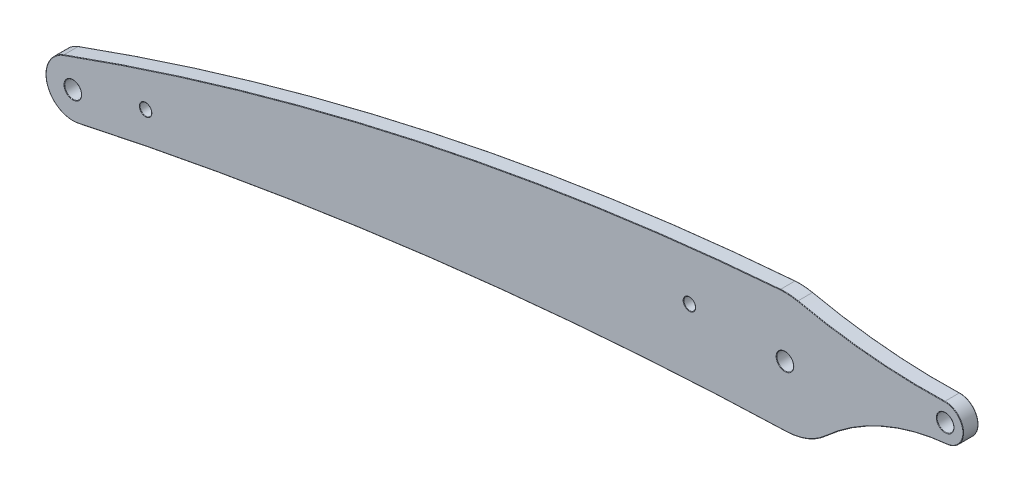
ISO-10303-21;
HEADER;
FILE_DESCRIPTION(('STEP AP214'),'2;1');
FILE_NAME('part.step','',(''),(''),'','','');
FILE_SCHEMA(('AUTOMOTIVE_DESIGN { 1 0 10303 214 1 1 1 1 }'));
ENDSEC;
DATA;
#1=APPLICATION_CONTEXT('core data for automotive mechanical design processes');
#2=APPLICATION_PROTOCOL_DEFINITION('international standard','automotive_design',2000,#1);
#3=PRODUCT_CONTEXT('',#1,'mechanical');
#4=PRODUCT('Part','Part','',(#3));
#5=PRODUCT_RELATED_PRODUCT_CATEGORY('part','',(#4));
#6=PRODUCT_DEFINITION_FORMATION('','',#4);
#7=PRODUCT_DEFINITION_CONTEXT('part definition',#1,'design');
#8=PRODUCT_DEFINITION('design','',#6,#7);
#9=PRODUCT_DEFINITION_SHAPE('','',#8);
#10=(LENGTH_UNIT() NAMED_UNIT(*) SI_UNIT(.MILLI.,.METRE.));
#11=(NAMED_UNIT(*) PLANE_ANGLE_UNIT() SI_UNIT($,.RADIAN.));
#12=(NAMED_UNIT(*) SI_UNIT($,.STERADIAN.) SOLID_ANGLE_UNIT());
#13=UNCERTAINTY_MEASURE_WITH_UNIT(LENGTH_MEASURE(1.E-05),#10,'distance_accuracy_value','');
#14=(GEOMETRIC_REPRESENTATION_CONTEXT(3) GLOBAL_UNCERTAINTY_ASSIGNED_CONTEXT((#13)) GLOBAL_UNIT_ASSIGNED_CONTEXT((#10,
#11,#12)) REPRESENTATION_CONTEXT('',''));
#15=CARTESIAN_POINT('',(0.,0.,0.));
#16=DIRECTION('',(0.,0.,1.));
#17=DIRECTION('',(1.,0.,0.));
#18=AXIS2_PLACEMENT_3D('',#15,#16,#17);
#19=CARTESIAN_POINT('',(-273.701360714426,238.82392189989,-5.));
#20=DIRECTION('',(0.,0.,1.));
#21=DIRECTION('',(1.,0.,0.));
#22=AXIS2_PLACEMENT_3D('',#19,#20,#21);
#23=CYLINDRICAL_SURFACE('',#22,8.99999999999995);
#24=DIRECTION('',(0.,0.,1.));
#25=VECTOR('',#24,1.);
#26=CARTESIAN_POINT('',(-276.780298858593,247.280879976196,-5.));
#27=LINE('',#26,#25);
#28=CARTESIAN_POINT('',(-276.780298858593,247.280879976196,-4.85));
#29=VERTEX_POINT('',#28);
#30=CARTESIAN_POINT('',(-276.780298858593,247.280879976196,-0.15));
#31=VERTEX_POINT('',#30);
#32=EDGE_CURVE('E156',#29,#31,#27,.T.);
#33=ORIENTED_EDGE('',*,*,#32,.F.);
#34=CARTESIAN_POINT('',(-273.701360714426,238.82392189989,-4.85));
#35=DIRECTION('',(0.,0.,1.));
#36=DIRECTION('',(1.,0.,0.));
#37=AXIS2_PLACEMENT_3D('',#34,#35,#36);
#38=CIRCLE('',#37,8.99999999999995);
#39=CARTESIAN_POINT('',(-271.793567604584,230.028450027953,-4.85));
#40=VERTEX_POINT('',#39);
#41=EDGE_CURVE('E151',#29,#40,#38,.T.);
#42=ORIENTED_EDGE('',*,*,#41,.T.);
#43=DIRECTION('',(0.,0.,1.));
#44=VECTOR('',#43,1.);
#45=CARTESIAN_POINT('',(-271.793567604584,230.028450027953,-5.));
#46=LINE('',#45,#44);
#47=CARTESIAN_POINT('',(-271.793567604584,230.028450027953,-0.15));
#48=VERTEX_POINT('',#47);
#49=EDGE_CURVE('E153',#40,#48,#46,.T.);
#50=ORIENTED_EDGE('',*,*,#49,.T.);
#51=CARTESIAN_POINT('',(-273.701360714426,238.82392189989,-0.15));
#52=DIRECTION('',(0.,0.,1.));
#53=DIRECTION('',(1.,0.,0.));
#54=AXIS2_PLACEMENT_3D('',#51,#52,#53);
#55=CIRCLE('',#54,8.99999999999995);
#56=EDGE_CURVE('E162',#48,#31,#55,.F.);
#57=ORIENTED_EDGE('',*,*,#56,.T.);
#58=EDGE_LOOP('',(#33,#42,#50,#57));
#59=FACE_BOUND('',#58,.T.);
#60=ADVANCED_FACE('F37',(#59),#23,.T.);
#61=CARTESIAN_POINT('',(31.1135155580963,-598.414927654386,-5.));
#62=DIRECTION('',(0.,0.,1.));
#63=DIRECTION('',(1.,0.,0.));
#64=AXIS2_PLACEMENT_3D('',#61,#62,#63);
#65=CYLINDRICAL_SURFACE('',#64,900.);
#66=DIRECTION('',(0.,0.,1.));
#67=VECTOR('',#66,1.);
#68=CARTESIAN_POINT('',(-38.6274540706312,298.878891089087,-5.));
#69=LINE('',#68,#67);
#70=CARTESIAN_POINT('',(-38.6274540706312,298.878891089087,-4.85));
#71=VERTEX_POINT('',#70);
#72=CARTESIAN_POINT('',(-38.6274540706312,298.878891089087,-0.15));
#73=VERTEX_POINT('',#72);
#74=EDGE_CURVE('E373',#71,#73,#69,.T.);
#75=ORIENTED_EDGE('',*,*,#74,.F.);
#76=CARTESIAN_POINT('',(31.1135155580963,-598.414927654386,-4.85));
#77=DIRECTION('',(0.,0.,1.));
#78=DIRECTION('',(1.,0.,0.));
#79=AXIS2_PLACEMENT_3D('',#76,#77,#78);
#80=CIRCLE('',#79,900.);
#81=EDGE_CURVE('E245',#71,#29,#80,.T.);
#82=ORIENTED_EDGE('',*,*,#81,.T.);
#83=ORIENTED_EDGE('',*,*,#32,.T.);
#84=CARTESIAN_POINT('',(31.1135155580963,-598.414927654386,-0.15));
#85=DIRECTION('',(0.,0.,1.));
#86=DIRECTION('',(1.,0.,0.));
#87=AXIS2_PLACEMENT_3D('',#84,#85,#86);
#88=CIRCLE('',#87,900.);
#89=EDGE_CURVE('E242',#31,#73,#88,.F.);
#90=ORIENTED_EDGE('',*,*,#89,.T.);
#91=EDGE_LOOP('',(#75,#82,#83,#90));
#92=FACE_BOUND('',#91,.T.);
#93=ADVANCED_FACE('F379',(#92),#65,.T.);
#94=CARTESIAN_POINT('',(-37.0776547455483,278.939028450343,-5.));
#95=DIRECTION('',(0.,0.,1.));
#96=DIRECTION('',(1.,0.,0.));
#97=AXIS2_PLACEMENT_3D('',#94,#95,#96);
#98=CYLINDRICAL_SURFACE('',#97,20.0000000000001);
#99=DIRECTION('',(0.,0.,1.));
#100=VECTOR('',#99,1.);
#101=CARTESIAN_POINT('',(-32.8087402126741,298.478126912427,-5.));
#102=LINE('',#101,#100);
#103=CARTESIAN_POINT('',(-32.8087402126741,298.478126912427,-4.85));
#104=VERTEX_POINT('',#103);
#105=CARTESIAN_POINT('',(-32.8087402126741,298.478126912427,-0.15));
#106=VERTEX_POINT('',#105);
#107=EDGE_CURVE('E370',#104,#106,#102,.T.);
#108=ORIENTED_EDGE('',*,*,#107,.F.);
#109=CARTESIAN_POINT('',(-37.0776547455483,278.939028450343,-4.85));
#110=DIRECTION('',(0.,0.,1.));
#111=DIRECTION('',(1.,0.,0.));
#112=AXIS2_PLACEMENT_3D('',#109,#110,#111);
#113=CIRCLE('',#112,20.0000000000001);
#114=EDGE_CURVE('E240',#104,#71,#113,.T.);
#115=ORIENTED_EDGE('',*,*,#114,.T.);
#116=ORIENTED_EDGE('',*,*,#74,.T.);
#117=CARTESIAN_POINT('',(-37.0776547455483,278.939028450343,-0.15));
#118=DIRECTION('',(0.,0.,1.));
#119=DIRECTION('',(1.,0.,0.));
#120=AXIS2_PLACEMENT_3D('',#117,#118,#119);
#121=CIRCLE('',#120,20.0000000000001);
#122=EDGE_CURVE('E238',#73,#106,#121,.F.);
#123=ORIENTED_EDGE('',*,*,#122,.T.);
#124=EDGE_LOOP('',(#108,#115,#116,#123));
#125=FACE_BOUND('',#124,.T.);
#126=ADVANCED_FACE('F433',(#125),#98,.T.);
#127=CARTESIAN_POINT('',(9.88040511606791,493.869111533268,-5.));
#128=DIRECTION('',(0.,0.,1.));
#129=DIRECTION('',(1.,0.,0.));
#130=AXIS2_PLACEMENT_3D('',#127,#128,#129);
#131=CYLINDRICAL_SURFACE('',#130,200.);
#132=DIRECTION('',(0.,0.,1.));
#133=VECTOR('',#132,1.);
#134=CARTESIAN_POINT('',(15.9797002436225,293.962136670091,-5.));
#135=LINE('',#134,#133);
#136=CARTESIAN_POINT('',(15.9797002436225,293.962136670091,-4.85));
#137=VERTEX_POINT('',#136);
#138=CARTESIAN_POINT('',(15.9797002436225,293.962136670091,-0.15));
#139=VERTEX_POINT('',#138);
#140=EDGE_CURVE('E364',#137,#139,#135,.T.);
#141=ORIENTED_EDGE('',*,*,#140,.F.);
#142=CARTESIAN_POINT('',(9.88040511606791,493.869111533268,-4.85));
#143=DIRECTION('',(0.,0.,1.));
#144=DIRECTION('',(1.,0.,0.));
#145=AXIS2_PLACEMENT_3D('',#142,#143,#144);
#146=CIRCLE('',#145,200.);
#147=EDGE_CURVE('E236',#137,#104,#146,.F.);
#148=ORIENTED_EDGE('',*,*,#147,.T.);
#149=ORIENTED_EDGE('',*,*,#107,.T.);
#150=CARTESIAN_POINT('',(9.88040511606791,493.869111533268,-0.15));
#151=DIRECTION('',(0.,0.,1.));
#152=DIRECTION('',(1.,0.,0.));
#153=AXIS2_PLACEMENT_3D('',#150,#151,#152);
#154=CIRCLE('',#153,200.);
#155=EDGE_CURVE('E234',#106,#139,#154,.T.);
#156=ORIENTED_EDGE('',*,*,#155,.T.);
#157=EDGE_LOOP('',(#141,#148,#149,#156));
#158=FACE_BOUND('',#157,.T.);
#159=ADVANCED_FACE('F726',(#158),#131,.F.);
#160=CARTESIAN_POINT('',(16.1626790974491,287.964927424195,-5.));
#161=DIRECTION('',(0.,0.,1.));
#162=DIRECTION('',(1.,0.,0.));
#163=AXIS2_PLACEMENT_3D('',#160,#161,#162);
#164=CYLINDRICAL_SURFACE('',#163,6.);
#165=DIRECTION('',(0.,0.,1.));
#166=VECTOR('',#165,1.);
#167=CARTESIAN_POINT('',(16.7362842066318,281.992408928726,-5.));
#168=LINE('',#167,#166);
#169=CARTESIAN_POINT('',(16.7362842066318,281.992408928726,-4.85));
#170=VERTEX_POINT('',#169);
#171=CARTESIAN_POINT('',(16.7362842066318,281.992408928726,-0.15));
#172=VERTEX_POINT('',#171);
#173=EDGE_CURVE('E360',#170,#172,#168,.T.);
#174=ORIENTED_EDGE('',*,*,#173,.F.);
#175=CARTESIAN_POINT('',(16.1626790974491,287.964927424195,-4.85));
#176=DIRECTION('',(0.,0.,1.));
#177=DIRECTION('',(1.,0.,0.));
#178=AXIS2_PLACEMENT_3D('',#175,#176,#177);
#179=CIRCLE('',#178,6.);
#180=EDGE_CURVE('E232',#170,#137,#179,.T.);
#181=ORIENTED_EDGE('',*,*,#180,.T.);
#182=ORIENTED_EDGE('',*,*,#140,.T.);
#183=CARTESIAN_POINT('',(16.1626790974491,287.964927424195,-0.15));
#184=DIRECTION('',(0.,0.,1.));
#185=DIRECTION('',(1.,0.,0.));
#186=AXIS2_PLACEMENT_3D('',#183,#184,#185);
#187=CIRCLE('',#186,6.);
#188=EDGE_CURVE('E230',#139,#172,#187,.F.);
#189=ORIENTED_EDGE('',*,*,#188,.T.);
#190=EDGE_LOOP('',(#174,#181,#182,#189));
#191=FACE_BOUND('',#190,.T.);
#192=ADVANCED_FACE('F718',(#191),#164,.T.);
#193=CARTESIAN_POINT('',(23.4283438137629,212.313026481588,-5.));
#194=DIRECTION('',(0.,0.,1.));
#195=DIRECTION('',(1.,0.,0.));
#196=AXIS2_PLACEMENT_3D('',#193,#194,#195);
#197=CYLINDRICAL_SURFACE('',#196,70.);
#198=DIRECTION('',(0.,0.,1.));
#199=VECTOR('',#198,1.);
#200=CARTESIAN_POINT('',(-23.6318772879236,264.133250235064,-5.));
#201=LINE('',#200,#199);
#202=CARTESIAN_POINT('',(-23.6318772879236,264.133250235064,-4.85));
#203=VERTEX_POINT('',#202);
#204=CARTESIAN_POINT('',(-23.6318772879236,264.133250235064,-0.15));
#205=VERTEX_POINT('',#204);
#206=EDGE_CURVE('E357',#203,#205,#201,.T.);
#207=ORIENTED_EDGE('',*,*,#206,.F.);
#208=CARTESIAN_POINT('',(23.4283438137629,212.313026481588,-4.85));
#209=DIRECTION('',(0.,0.,1.));
#210=DIRECTION('',(1.,0.,0.));
#211=AXIS2_PLACEMENT_3D('',#208,#209,#210);
#212=CIRCLE('',#211,70.);
#213=EDGE_CURVE('E228',#203,#170,#212,.F.);
#214=ORIENTED_EDGE('',*,*,#213,.T.);
#215=ORIENTED_EDGE('',*,*,#173,.T.);
#216=CARTESIAN_POINT('',(23.4283438137629,212.313026481588,-0.15));
#217=DIRECTION('',(0.,0.,1.));
#218=DIRECTION('',(1.,0.,0.));
#219=AXIS2_PLACEMENT_3D('',#216,#217,#218);
#220=CIRCLE('',#219,70.);
#221=EDGE_CURVE('E226',#172,#205,#220,.T.);
#222=ORIENTED_EDGE('',*,*,#221,.T.);
#223=EDGE_LOOP('',(#207,#214,#215,#222));
#224=FACE_BOUND('',#223,.T.);
#225=ADVANCED_FACE('F356',(#224),#197,.F.);
#226=CARTESIAN_POINT('',(-37.0776547455483,278.939028450343,-5.));
#227=DIRECTION('',(0.,0.,1.));
#228=DIRECTION('',(1.,0.,0.));
#229=AXIS2_PLACEMENT_3D('',#226,#227,#228);
#230=CYLINDRICAL_SURFACE('',#229,20.);
#231=DIRECTION('',(0.,0.,1.));
#232=VECTOR('',#231,1.);
#233=CARTESIAN_POINT('',(-36.4586516696847,258.94860986563,-5.));
#234=LINE('',#233,#232);
#235=CARTESIAN_POINT('',(-36.4586516696847,258.94860986563,-4.85));
#236=VERTEX_POINT('',#235);
#237=CARTESIAN_POINT('',(-36.4586516696847,258.94860986563,-0.15));
#238=VERTEX_POINT('',#237);
#239=EDGE_CURVE('E173',#236,#238,#234,.T.);
#240=ORIENTED_EDGE('',*,*,#239,.F.);
#241=CARTESIAN_POINT('',(-37.0776547455483,278.939028450343,-4.85));
#242=DIRECTION('',(0.,0.,1.));
#243=DIRECTION('',(1.,0.,0.));
#244=AXIS2_PLACEMENT_3D('',#241,#242,#243);
#245=CIRCLE('',#244,20.);
#246=EDGE_CURVE('E224',#236,#203,#245,.T.);
#247=ORIENTED_EDGE('',*,*,#246,.T.);
#248=ORIENTED_EDGE('',*,*,#206,.T.);
#249=CARTESIAN_POINT('',(-37.0776547455483,278.939028450343,-0.15));
#250=DIRECTION('',(0.,0.,1.));
#251=DIRECTION('',(1.,0.,0.));
#252=AXIS2_PLACEMENT_3D('',#249,#250,#251);
#253=CIRCLE('',#252,20.);
#254=EDGE_CURVE('E222',#205,#238,#253,.F.);
#255=ORIENTED_EDGE('',*,*,#254,.T.);
#256=EDGE_LOOP('',(#240,#247,#248,#255));
#257=FACE_BOUND('',#256,.T.);
#258=ADVANCED_FACE('F362',(#257),#230,.T.);
#259=CARTESIAN_POINT('',(3.77654826145224,-1040.42859814077,-5.));
#260=DIRECTION('',(0.,0.,1.));
#261=DIRECTION('',(1.,0.,0.));
#262=AXIS2_PLACEMENT_3D('',#259,#260,#261);
#263=CYLINDRICAL_SURFACE('',#262,1300.);
#264=ORIENTED_EDGE('',*,*,#49,.F.);
#265=CARTESIAN_POINT('',(3.77654826145224,-1040.42859814077,-4.85));
#266=DIRECTION('',(0.,0.,1.));
#267=DIRECTION('',(1.,0.,0.));
#268=AXIS2_PLACEMENT_3D('',#265,#266,#267);
#269=CIRCLE('',#268,1300.);
#270=EDGE_CURVE('E169',#40,#236,#269,.F.);
#271=ORIENTED_EDGE('',*,*,#270,.T.);
#272=ORIENTED_EDGE('',*,*,#239,.T.);
#273=CARTESIAN_POINT('',(3.77654826145224,-1040.42859814077,-0.15));
#274=DIRECTION('',(0.,0.,1.));
#275=DIRECTION('',(1.,0.,0.));
#276=AXIS2_PLACEMENT_3D('',#273,#274,#275);
#277=CIRCLE('',#276,1300.);
#278=EDGE_CURVE('E172',#238,#48,#277,.T.);
#279=ORIENTED_EDGE('',*,*,#278,.T.);
#280=EDGE_LOOP('',(#264,#271,#272,#279));
#281=FACE_BOUND('',#280,.T.);
#282=ADVANCED_FACE('F166',(#281),#263,.F.);
#283=CARTESIAN_POINT('',(-134.962406226487,-400.802338120439,-5.));
#284=DIRECTION('',(0.,0.,1.));
#285=DIRECTION('',(1.,0.,0.));
#286=AXIS2_PLACEMENT_3D('',#283,#284,#285);
#287=PLANE('',#286);
#288=CARTESIAN_POINT('',(-37.0776547455483,278.939028450343,-5.));
#289=DIRECTION('',(0.,0.,1.));
#290=DIRECTION('',(1.,0.,0.));
#291=AXIS2_PLACEMENT_3D('',#288,#289,#290);
#292=CIRCLE('',#291,19.85);
#293=CARTESIAN_POINT('',(-23.7327206188558,264.244293571679,-5.));
#294=VERTEX_POINT('',#293);
#295=CARTESIAN_POINT('',(-36.4632941927537,259.098538005015,-5.));
#296=VERTEX_POINT('',#295);
#297=EDGE_CURVE('E218',#294,#296,#292,.F.);
#298=ORIENTED_EDGE('',*,*,#297,.T.);
#299=CARTESIAN_POINT('',(3.77654826145224,-1040.42859814077,-5.));
#300=DIRECTION('',(0.,0.,1.));
#301=DIRECTION('',(1.,0.,0.));
#302=AXIS2_PLACEMENT_3D('',#299,#300,#301);
#303=CIRCLE('',#302,1300.15);
#304=CARTESIAN_POINT('',(-271.825364156415,230.175041225818,-5.));
#305=VERTEX_POINT('',#304);
#306=EDGE_CURVE('E220',#296,#305,#303,.T.);
#307=ORIENTED_EDGE('',*,*,#306,.T.);
#308=CARTESIAN_POINT('',(-273.701360714426,238.82392189989,-5.));
#309=DIRECTION('',(0.,0.,1.));
#310=DIRECTION('',(1.,0.,0.));
#311=AXIS2_PLACEMENT_3D('',#308,#309,#310);
#312=CIRCLE('',#311,8.84999999999995);
#313=CARTESIAN_POINT('',(-276.728983222856,247.139930674924,-5.));
#314=VERTEX_POINT('',#313);
#315=EDGE_CURVE('E179',#305,#314,#312,.F.);
#316=ORIENTED_EDGE('',*,*,#315,.T.);
#317=CARTESIAN_POINT('',(31.1135155580963,-598.414927654386,-5.));
#318=DIRECTION('',(0.,0.,1.));
#319=DIRECTION('',(1.,0.,0.));
#320=AXIS2_PLACEMENT_3D('',#317,#318,#319);
#321=CIRCLE('',#320,899.85);
#322=CARTESIAN_POINT('',(-38.6158305756931,298.729342119297,-5.));
#323=VERTEX_POINT('',#322);
#324=EDGE_CURVE('E208',#314,#323,#321,.F.);
#325=ORIENTED_EDGE('',*,*,#324,.T.);
#326=CARTESIAN_POINT('',(-37.0776547455483,278.939028450343,-5.));
#327=DIRECTION('',(0.,0.,1.));
#328=DIRECTION('',(1.,0.,0.));
#329=AXIS2_PLACEMENT_3D('',#326,#327,#328);
#330=CIRCLE('',#329,19.8500000000001);
#331=CARTESIAN_POINT('',(-32.8407570716706,298.331583673962,-5.));
#332=VERTEX_POINT('',#331);
#333=EDGE_CURVE('E210',#323,#332,#330,.F.);
#334=ORIENTED_EDGE('',*,*,#333,.T.);
#335=CARTESIAN_POINT('',(9.88040511606791,493.869111533268,-5.));
#336=DIRECTION('',(0.,0.,1.));
#337=DIRECTION('',(1.,0.,0.));
#338=AXIS2_PLACEMENT_3D('',#335,#336,#337);
#339=CIRCLE('',#338,200.15);
#340=CARTESIAN_POINT('',(15.9842747149681,293.812206438943,-5.));
#341=VERTEX_POINT('',#340);
#342=EDGE_CURVE('E212',#332,#341,#339,.T.);
#343=ORIENTED_EDGE('',*,*,#342,.T.);
#344=CARTESIAN_POINT('',(16.1626790974491,287.964927424195,-5.));
#345=DIRECTION('',(0.,0.,1.));
#346=DIRECTION('',(1.,0.,0.));
#347=AXIS2_PLACEMENT_3D('',#344,#345,#346);
#348=CIRCLE('',#347,5.85);
#349=CARTESIAN_POINT('',(16.7219440789022,282.141721891113,-5.));
#350=VERTEX_POINT('',#349);
#351=EDGE_CURVE('E214',#341,#350,#348,.F.);
#352=ORIENTED_EDGE('',*,*,#351,.T.);
#353=CARTESIAN_POINT('',(23.4283438137629,212.313026481588,-5.));
#354=DIRECTION('',(0.,0.,1.));
#355=DIRECTION('',(1.,0.,0.));
#356=AXIS2_PLACEMENT_3D('',#353,#354,#355);
#357=CIRCLE('',#356,70.15);
#358=EDGE_CURVE('E216',#350,#294,#357,.T.);
#359=ORIENTED_EDGE('',*,*,#358,.T.);
#360=EDGE_LOOP('',(#298,#307,#316,#325,#334,#343,#352,#359));
#361=FACE_BOUND('',#360,.T.);
#362=CARTESIAN_POINT('',(-273.701360714426,238.82392189989,-5.));
#363=DIRECTION('',(0.,0.,1.));
#364=DIRECTION('',(1.,0.,0.));
#365=AXIS2_PLACEMENT_3D('',#362,#363,#364);
#366=CIRCLE('',#365,2.95);
#367=CARTESIAN_POINT('',(-270.751360714426,238.82392189989,-5.));
#368=VERTEX_POINT('',#367);
#369=EDGE_CURVE('E204',#368,#368,#366,.T.);
#370=ORIENTED_EDGE('',*,*,#369,.T.);
#371=EDGE_LOOP('',(#370));
#372=FACE_BOUND('',#371,.T.);
#373=CARTESIAN_POINT('',(-249.527266647018,245.196768675086,-5.));
#374=DIRECTION('',(0.,0.,1.));
#375=DIRECTION('',(1.,0.,0.));
#376=AXIS2_PLACEMENT_3D('',#373,#374,#375);
#377=CIRCLE('',#376,2.1);
#378=CARTESIAN_POINT('',(-247.427266647018,245.196768675086,-5.));
#379=VERTEX_POINT('',#378);
#380=EDGE_CURVE('E201',#379,#379,#377,.T.);
#381=ORIENTED_EDGE('',*,*,#380,.T.);
#382=EDGE_LOOP('',(#381));
#383=FACE_BOUND('',#382,.T.);
#384=CARTESIAN_POINT('',(-68.8276547455483,279.587808188343,-5.));
#385=DIRECTION('',(0.,0.,1.));
#386=DIRECTION('',(1.,0.,0.));
#387=AXIS2_PLACEMENT_3D('',#384,#385,#386);
#388=CIRCLE('',#387,2.09999999999999);
#389=CARTESIAN_POINT('',(-66.7276547455483,279.587808188343,-5.));
#390=VERTEX_POINT('',#389);
#391=EDGE_CURVE('E198',#390,#390,#388,.T.);
#392=ORIENTED_EDGE('',*,*,#391,.T.);
#393=EDGE_LOOP('',(#392));
#394=FACE_BOUND('',#393,.T.);
#395=CARTESIAN_POINT('',(-37.0776547455483,278.939028450343,-5.));
#396=DIRECTION('',(0.,0.,1.));
#397=DIRECTION('',(1.,0.,0.));
#398=AXIS2_PLACEMENT_3D('',#395,#396,#397);
#399=CIRCLE('',#398,2.95000000000001);
#400=CARTESIAN_POINT('',(-34.1276547455483,278.939028450343,-5.));
#401=VERTEX_POINT('',#400);
#402=EDGE_CURVE('E192',#401,#401,#399,.T.);
#403=ORIENTED_EDGE('',*,*,#402,.T.);
#404=EDGE_LOOP('',(#403));
#405=FACE_BOUND('',#404,.T.);
#406=CARTESIAN_POINT('',(16.1626790974491,287.964927424195,-5.));
#407=DIRECTION('',(0.,0.,1.));
#408=DIRECTION('',(1.,0.,0.));
#409=AXIS2_PLACEMENT_3D('',#406,#407,#408);
#410=CIRCLE('',#409,2.95000000000001);
#411=CARTESIAN_POINT('',(19.1126790974491,287.964927424195,-5.));
#412=VERTEX_POINT('',#411);
#413=EDGE_CURVE('E189',#412,#412,#410,.T.);
#414=ORIENTED_EDGE('',*,*,#413,.T.);
#415=EDGE_LOOP('',(#414));
#416=FACE_BOUND('',#415,.T.);
#417=ADVANCED_FACE('F395',(#361,#372,#383,#394,#405,#416),#287,.F.);
#418=CARTESIAN_POINT('',(-134.962406226487,-400.802338120439,0.));
#419=DIRECTION('',(0.,0.,1.));
#420=DIRECTION('',(1.,0.,0.));
#421=AXIS2_PLACEMENT_3D('',#418,#419,#420);
#422=PLANE('',#421);
#423=CARTESIAN_POINT('',(-37.0776547455483,278.939028450343,0.));
#424=DIRECTION('',(0.,0.,1.));
#425=DIRECTION('',(1.,0.,0.));
#426=AXIS2_PLACEMENT_3D('',#423,#424,#425);
#427=CIRCLE('',#426,19.8500000000001);
#428=CARTESIAN_POINT('',(-32.8407570716707,298.331583673962,0.));
#429=VERTEX_POINT('',#428);
#430=CARTESIAN_POINT('',(-38.6158305756931,298.729342119297,0.));
#431=VERTEX_POINT('',#430);
#432=EDGE_CURVE('E46',#429,#431,#427,.T.);
#433=ORIENTED_EDGE('',*,*,#432,.T.);
#434=CARTESIAN_POINT('',(31.1135155580963,-598.414927654386,0.));
#435=DIRECTION('',(0.,0.,1.));
#436=DIRECTION('',(1.,0.,0.));
#437=AXIS2_PLACEMENT_3D('',#434,#435,#436);
#438=CIRCLE('',#437,899.85);
#439=CARTESIAN_POINT('',(-276.728983222856,247.139930674924,0.));
#440=VERTEX_POINT('',#439);
#441=EDGE_CURVE('E11',#431,#440,#438,.T.);
#442=ORIENTED_EDGE('',*,*,#441,.T.);
#443=CARTESIAN_POINT('',(-273.701360714426,238.82392189989,0.));
#444=DIRECTION('',(0.,0.,1.));
#445=DIRECTION('',(1.,0.,0.));
#446=AXIS2_PLACEMENT_3D('',#443,#444,#445);
#447=CIRCLE('',#446,8.84999999999995);
#448=CARTESIAN_POINT('',(-271.825364156415,230.175041225818,0.));
#449=VERTEX_POINT('',#448);
#450=EDGE_CURVE('E292',#440,#449,#447,.T.);
#451=ORIENTED_EDGE('',*,*,#450,.T.);
#452=CARTESIAN_POINT('',(3.77654826145224,-1040.42859814077,0.));
#453=DIRECTION('',(0.,0.,1.));
#454=DIRECTION('',(1.,0.,0.));
#455=AXIS2_PLACEMENT_3D('',#452,#453,#454);
#456=CIRCLE('',#455,1300.15);
#457=CARTESIAN_POINT('',(-36.4632941927537,259.098538005015,0.));
#458=VERTEX_POINT('',#457);
#459=EDGE_CURVE('E294',#449,#458,#456,.F.);
#460=ORIENTED_EDGE('',*,*,#459,.T.);
#461=CARTESIAN_POINT('',(-37.0776547455483,278.939028450343,0.));
#462=DIRECTION('',(0.,0.,1.));
#463=DIRECTION('',(1.,0.,0.));
#464=AXIS2_PLACEMENT_3D('',#461,#462,#463);
#465=CIRCLE('',#464,19.85);
#466=CARTESIAN_POINT('',(-23.7327206188558,264.244293571679,0.));
#467=VERTEX_POINT('',#466);
#468=EDGE_CURVE('E296',#458,#467,#465,.T.);
#469=ORIENTED_EDGE('',*,*,#468,.T.);
#470=CARTESIAN_POINT('',(23.4283438137629,212.313026481588,0.));
#471=DIRECTION('',(0.,0.,1.));
#472=DIRECTION('',(1.,0.,0.));
#473=AXIS2_PLACEMENT_3D('',#470,#471,#472);
#474=CIRCLE('',#473,70.15);
#475=CARTESIAN_POINT('',(16.7219440789022,282.141721891113,0.));
#476=VERTEX_POINT('',#475);
#477=EDGE_CURVE('E298',#467,#476,#474,.F.);
#478=ORIENTED_EDGE('',*,*,#477,.T.);
#479=CARTESIAN_POINT('',(16.1626790974491,287.964927424195,0.));
#480=DIRECTION('',(0.,0.,1.));
#481=DIRECTION('',(1.,0.,0.));
#482=AXIS2_PLACEMENT_3D('',#479,#480,#481);
#483=CIRCLE('',#482,5.85);
#484=CARTESIAN_POINT('',(15.9842747149682,293.812206438943,0.));
#485=VERTEX_POINT('',#484);
#486=EDGE_CURVE('E300',#476,#485,#483,.T.);
#487=ORIENTED_EDGE('',*,*,#486,.T.);
#488=CARTESIAN_POINT('',(9.88040511606791,493.869111533268,0.));
#489=DIRECTION('',(0.,0.,1.));
#490=DIRECTION('',(1.,0.,0.));
#491=AXIS2_PLACEMENT_3D('',#488,#489,#490);
#492=CIRCLE('',#491,200.15);
#493=EDGE_CURVE('E57',#485,#429,#492,.F.);
#494=ORIENTED_EDGE('',*,*,#493,.T.);
#495=EDGE_LOOP('',(#433,#442,#451,#460,#469,#478,#487,#494));
#496=FACE_BOUND('',#495,.T.);
#497=CARTESIAN_POINT('',(-273.701360714426,238.82392189989,0.));
#498=DIRECTION('',(0.,0.,1.));
#499=DIRECTION('',(1.,0.,0.));
#500=AXIS2_PLACEMENT_3D('',#497,#498,#499);
#501=CIRCLE('',#500,2.95);
#502=CARTESIAN_POINT('',(-270.751360714426,238.82392189989,0.));
#503=VERTEX_POINT('',#502);
#504=EDGE_CURVE('E289',#503,#503,#501,.F.);
#505=ORIENTED_EDGE('',*,*,#504,.T.);
#506=EDGE_LOOP('',(#505));
#507=FACE_BOUND('',#506,.T.);
#508=CARTESIAN_POINT('',(-249.527266647018,245.196768675086,0.));
#509=DIRECTION('',(0.,0.,1.));
#510=DIRECTION('',(1.,0.,0.));
#511=AXIS2_PLACEMENT_3D('',#508,#509,#510);
#512=CIRCLE('',#511,2.1);
#513=CARTESIAN_POINT('',(-247.427266647018,245.196768675086,0.));
#514=VERTEX_POINT('',#513);
#515=EDGE_CURVE('E286',#514,#514,#512,.F.);
#516=ORIENTED_EDGE('',*,*,#515,.T.);
#517=EDGE_LOOP('',(#516));
#518=FACE_BOUND('',#517,.T.);
#519=CARTESIAN_POINT('',(-68.8276547455483,279.587808188343,0.));
#520=DIRECTION('',(0.,0.,1.));
#521=DIRECTION('',(1.,0.,0.));
#522=AXIS2_PLACEMENT_3D('',#519,#520,#521);
#523=CIRCLE('',#522,2.09999999999999);
#524=CARTESIAN_POINT('',(-66.7276547455483,279.587808188343,0.));
#525=VERTEX_POINT('',#524);
#526=EDGE_CURVE('E283',#525,#525,#523,.F.);
#527=ORIENTED_EDGE('',*,*,#526,.T.);
#528=EDGE_LOOP('',(#527));
#529=FACE_BOUND('',#528,.T.);
#530=CARTESIAN_POINT('',(-37.0776547455483,278.939028450343,0.));
#531=DIRECTION('',(0.,0.,1.));
#532=DIRECTION('',(1.,0.,0.));
#533=AXIS2_PLACEMENT_3D('',#530,#531,#532);
#534=CIRCLE('',#533,2.95000000000001);
#535=CARTESIAN_POINT('',(-34.1276547455483,278.939028450343,0.));
#536=VERTEX_POINT('',#535);
#537=EDGE_CURVE('E280',#536,#536,#534,.F.);
#538=ORIENTED_EDGE('',*,*,#537,.T.);
#539=EDGE_LOOP('',(#538));
#540=FACE_BOUND('',#539,.T.);
#541=CARTESIAN_POINT('',(16.1626790974491,287.964927424195,0.));
#542=DIRECTION('',(0.,0.,1.));
#543=DIRECTION('',(1.,0.,0.));
#544=AXIS2_PLACEMENT_3D('',#541,#542,#543);
#545=CIRCLE('',#544,2.95000000000001);
#546=CARTESIAN_POINT('',(19.1126790974491,287.964927424195,0.));
#547=VERTEX_POINT('',#546);
#548=EDGE_CURVE('E277',#547,#547,#545,.F.);
#549=ORIENTED_EDGE('',*,*,#548,.T.);
#550=EDGE_LOOP('',(#549));
#551=FACE_BOUND('',#550,.T.);
#552=ADVANCED_FACE('F391',(#496,#507,#518,#529,#540,#551),#422,.T.);
#553=CARTESIAN_POINT('',(-273.701360714426,238.82392189989,-5.));
#554=DIRECTION('',(0.,0.,1.));
#555=DIRECTION('',(1.,0.,0.));
#556=AXIS2_PLACEMENT_3D('',#553,#554,#555);
#557=CYLINDRICAL_SURFACE('',#556,2.8);
#558=CARTESIAN_POINT('',(-273.701360714426,238.82392189989,-4.85));
#559=DIRECTION('',(0.,0.,1.));
#560=DIRECTION('',(1.,0.,0.));
#561=AXIS2_PLACEMENT_3D('',#558,#559,#560);
#562=CIRCLE('',#561,2.8);
#563=CARTESIAN_POINT('',(-270.901360714426,238.82392189989,-4.85));
#564=VERTEX_POINT('',#563);
#565=EDGE_CURVE('E250',#564,#564,#562,.F.);
#566=ORIENTED_EDGE('',*,*,#565,.T.);
#567=EDGE_LOOP('',(#566));
#568=FACE_BOUND('',#567,.T.);
#569=CARTESIAN_POINT('',(-273.701360714426,238.82392189989,-0.15));
#570=DIRECTION('',(0.,0.,1.));
#571=DIRECTION('',(1.,0.,0.));
#572=AXIS2_PLACEMENT_3D('',#569,#570,#571);
#573=CIRCLE('',#572,2.8);
#574=CARTESIAN_POINT('',(-270.901360714426,238.82392189989,-0.15));
#575=VERTEX_POINT('',#574);
#576=EDGE_CURVE('E161',#575,#575,#573,.T.);
#577=ORIENTED_EDGE('',*,*,#576,.T.);
#578=EDGE_LOOP('',(#577));
#579=FACE_BOUND('',#578,.T.);
#580=ADVANCED_FACE('F394',(#568,#579),#557,.F.);
#581=CARTESIAN_POINT('',(-249.527266647018,245.196768675086,-5.));
#582=DIRECTION('',(0.,0.,1.));
#583=DIRECTION('',(1.,0.,0.));
#584=AXIS2_PLACEMENT_3D('',#581,#582,#583);
#585=CYLINDRICAL_SURFACE('',#584,1.95);
#586=CARTESIAN_POINT('',(-249.527266647018,245.196768675086,-4.85));
#587=DIRECTION('',(0.,0.,1.));
#588=DIRECTION('',(1.,0.,0.));
#589=AXIS2_PLACEMENT_3D('',#586,#587,#588);
#590=CIRCLE('',#589,1.95);
#591=CARTESIAN_POINT('',(-247.577266647018,245.196768675086,-4.85));
#592=VERTEX_POINT('',#591);
#593=EDGE_CURVE('E256',#592,#592,#590,.F.);
#594=ORIENTED_EDGE('',*,*,#593,.T.);
#595=EDGE_LOOP('',(#594));
#596=FACE_BOUND('',#595,.T.);
#597=CARTESIAN_POINT('',(-249.527266647018,245.196768675086,-0.15));
#598=DIRECTION('',(0.,0.,1.));
#599=DIRECTION('',(1.,0.,0.));
#600=AXIS2_PLACEMENT_3D('',#597,#598,#599);
#601=CIRCLE('',#600,1.95);
#602=CARTESIAN_POINT('',(-247.577266647018,245.196768675086,-0.15));
#603=VERTEX_POINT('',#602);
#604=EDGE_CURVE('E253',#603,#603,#601,.T.);
#605=ORIENTED_EDGE('',*,*,#604,.T.);
#606=EDGE_LOOP('',(#605));
#607=FACE_BOUND('',#606,.T.);
#608=ADVANCED_FACE('F668',(#596,#607),#585,.F.);
#609=CARTESIAN_POINT('',(-68.8276547455483,279.587808188343,-5.));
#610=DIRECTION('',(0.,0.,1.));
#611=DIRECTION('',(1.,0.,0.));
#612=AXIS2_PLACEMENT_3D('',#609,#610,#611);
#613=CYLINDRICAL_SURFACE('',#612,1.94999999999999);
#614=CARTESIAN_POINT('',(-68.8276547455483,279.587808188343,-4.85));
#615=DIRECTION('',(0.,0.,1.));
#616=DIRECTION('',(1.,0.,0.));
#617=AXIS2_PLACEMENT_3D('',#614,#615,#616);
#618=CIRCLE('',#617,1.94999999999999);
#619=CARTESIAN_POINT('',(-66.8776547455483,279.587808188343,-4.85));
#620=VERTEX_POINT('',#619);
#621=EDGE_CURVE('E262',#620,#620,#618,.F.);
#622=ORIENTED_EDGE('',*,*,#621,.T.);
#623=EDGE_LOOP('',(#622));
#624=FACE_BOUND('',#623,.T.);
#625=CARTESIAN_POINT('',(-68.8276547455483,279.587808188343,-0.15));
#626=DIRECTION('',(0.,0.,1.));
#627=DIRECTION('',(1.,0.,0.));
#628=AXIS2_PLACEMENT_3D('',#625,#626,#627);
#629=CIRCLE('',#628,1.94999999999999);
#630=CARTESIAN_POINT('',(-66.8776547455483,279.587808188343,-0.15));
#631=VERTEX_POINT('',#630);
#632=EDGE_CURVE('E259',#631,#631,#629,.T.);
#633=ORIENTED_EDGE('',*,*,#632,.T.);
#634=EDGE_LOOP('',(#633));
#635=FACE_BOUND('',#634,.T.);
#636=ADVANCED_FACE('F425',(#624,#635),#613,.F.);
#637=CARTESIAN_POINT('',(-37.0776547455483,278.939028450343,-5.));
#638=DIRECTION('',(0.,0.,1.));
#639=DIRECTION('',(1.,0.,0.));
#640=AXIS2_PLACEMENT_3D('',#637,#638,#639);
#641=CYLINDRICAL_SURFACE('',#640,2.80000000000001);
#642=CARTESIAN_POINT('',(-37.0776547455483,278.939028450343,-4.85));
#643=DIRECTION('',(0.,0.,1.));
#644=DIRECTION('',(1.,0.,0.));
#645=AXIS2_PLACEMENT_3D('',#642,#643,#644);
#646=CIRCLE('',#645,2.80000000000001);
#647=CARTESIAN_POINT('',(-34.2776547455483,278.939028450343,-4.85));
#648=VERTEX_POINT('',#647);
#649=EDGE_CURVE('E268',#648,#648,#646,.F.);
#650=ORIENTED_EDGE('',*,*,#649,.T.);
#651=EDGE_LOOP('',(#650));
#652=FACE_BOUND('',#651,.T.);
#653=CARTESIAN_POINT('',(-37.0776547455483,278.939028450343,-0.15));
#654=DIRECTION('',(0.,0.,1.));
#655=DIRECTION('',(1.,0.,0.));
#656=AXIS2_PLACEMENT_3D('',#653,#654,#655);
#657=CIRCLE('',#656,2.80000000000001);
#658=CARTESIAN_POINT('',(-34.2776547455483,278.939028450343,-0.15));
#659=VERTEX_POINT('',#658);
#660=EDGE_CURVE('E265',#659,#659,#657,.T.);
#661=ORIENTED_EDGE('',*,*,#660,.T.);
#662=EDGE_LOOP('',(#661));
#663=FACE_BOUND('',#662,.T.);
#664=ADVANCED_FACE('F415',(#652,#663),#641,.F.);
#665=CARTESIAN_POINT('',(16.1626790974491,287.964927424195,-5.));
#666=DIRECTION('',(0.,0.,1.));
#667=DIRECTION('',(1.,0.,0.));
#668=AXIS2_PLACEMENT_3D('',#665,#666,#667);
#669=CYLINDRICAL_SURFACE('',#668,2.80000000000001);
#670=CARTESIAN_POINT('',(16.1626790974491,287.964927424195,-4.85));
#671=DIRECTION('',(0.,0.,1.));
#672=DIRECTION('',(1.,0.,0.));
#673=AXIS2_PLACEMENT_3D('',#670,#671,#672);
#674=CIRCLE('',#673,2.80000000000001);
#675=CARTESIAN_POINT('',(18.9626790974491,287.964927424195,-4.85));
#676=VERTEX_POINT('',#675);
#677=EDGE_CURVE('E274',#676,#676,#674,.F.);
#678=ORIENTED_EDGE('',*,*,#677,.T.);
#679=EDGE_LOOP('',(#678));
#680=FACE_BOUND('',#679,.T.);
#681=CARTESIAN_POINT('',(16.1626790974491,287.964927424195,-0.15));
#682=DIRECTION('',(0.,0.,1.));
#683=DIRECTION('',(1.,0.,0.));
#684=AXIS2_PLACEMENT_3D('',#681,#682,#683);
#685=CIRCLE('',#684,2.80000000000001);
#686=CARTESIAN_POINT('',(18.9626790974491,287.964927424195,-0.15));
#687=VERTEX_POINT('',#686);
#688=EDGE_CURVE('E271',#687,#687,#685,.T.);
#689=ORIENTED_EDGE('',*,*,#688,.T.);
#690=EDGE_LOOP('',(#689));
#691=FACE_BOUND('',#690,.T.);
#692=ADVANCED_FACE('F412',(#680,#691),#669,.F.);
#693=CARTESIAN_POINT('',(9.88040511606791,493.869111533268,-4.85));
#694=DIRECTION('',(0.,0.,1.));
#695=DIRECTION('',(1.,0.,0.));
#696=AXIS2_PLACEMENT_3D('',#693,#694,#695);
#697=TOROIDAL_SURFACE('',#696,200.15,0.15);
#698=CARTESIAN_POINT('',(15.9842747149681,293.812206438943,-4.85));
#699=DIRECTION('',(0.999534874315886,0.0304964756377688,0.));
#700=DIRECTION('',(-0.0304964756377689,0.999534874315887,0.));
#701=AXIS2_PLACEMENT_3D('',#698,#699,#700);
#702=CIRCLE('',#701,0.15);
#703=EDGE_CURVE('E315',#341,#137,#702,.T.);
#704=ORIENTED_EDGE('',*,*,#703,.F.);
#705=ORIENTED_EDGE('',*,*,#342,.F.);
#706=CARTESIAN_POINT('',(-32.8407570716707,298.331583673962,-4.85));
#707=DIRECTION('',(-0.976954923104203,0.213445726643708,0.));
#708=DIRECTION('',(-0.213445726643708,-0.976954923104203,0.));
#709=AXIS2_PLACEMENT_3D('',#706,#707,#708);
#710=CIRCLE('',#709,0.15);
#711=EDGE_CURVE('E174',#104,#332,#710,.T.);
#712=ORIENTED_EDGE('',*,*,#711,.F.);
#713=ORIENTED_EDGE('',*,*,#147,.F.);
#714=EDGE_LOOP('',(#704,#705,#712,#713));
#715=FACE_BOUND('',#714,.T.);
#716=ADVANCED_FACE('F414',(#715),#697,.T.);
#717=CARTESIAN_POINT('',(-37.0776547455483,278.939028450343,-4.85));
#718=DIRECTION('',(0.,0.,1.));
#719=DIRECTION('',(1.,0.,0.));
#720=AXIS2_PLACEMENT_3D('',#717,#718,#719);
#721=TOROIDAL_SURFACE('',#720,19.8500000000001,0.15);
#722=ORIENTED_EDGE('',*,*,#711,.T.);
#723=ORIENTED_EDGE('',*,*,#333,.F.);
#724=CARTESIAN_POINT('',(-38.6158305756931,298.729342119297,-4.85));
#725=DIRECTION('',(-0.996993131937193,-0.0774899662541361,0.));
#726=DIRECTION('',(0.0774899662541361,-0.996993131937193,0.));
#727=AXIS2_PLACEMENT_3D('',#724,#725,#726);
#728=CIRCLE('',#727,0.15);
#729=EDGE_CURVE('E312',#71,#323,#728,.T.);
#730=ORIENTED_EDGE('',*,*,#729,.F.);
#731=ORIENTED_EDGE('',*,*,#114,.F.);
#732=EDGE_LOOP('',(#722,#723,#730,#731));
#733=FACE_BOUND('',#732,.T.);
#734=ADVANCED_FACE('F422',(#733),#721,.T.);
#735=CARTESIAN_POINT('',(16.1626790974491,287.964927424195,-4.85));
#736=DIRECTION('',(0.,0.,1.));
#737=DIRECTION('',(1.,0.,0.));
#738=AXIS2_PLACEMENT_3D('',#735,#736,#737);
#739=TOROIDAL_SURFACE('',#738,5.85,0.15);
#740=ORIENTED_EDGE('',*,*,#703,.T.);
#741=ORIENTED_EDGE('',*,*,#180,.F.);
#742=CARTESIAN_POINT('',(16.7219440789022,282.141721891113,-4.85));
#743=DIRECTION('',(-0.995419749244837,-0.0956008515304456,0.));
#744=DIRECTION('',(0.0956008515304456,-0.995419749244837,0.));
#745=AXIS2_PLACEMENT_3D('',#742,#743,#744);
#746=CIRCLE('',#745,0.15);
#747=EDGE_CURVE('E309',#350,#170,#746,.T.);
#748=ORIENTED_EDGE('',*,*,#747,.F.);
#749=ORIENTED_EDGE('',*,*,#351,.F.);
#750=EDGE_LOOP('',(#740,#741,#748,#749));
#751=FACE_BOUND('',#750,.T.);
#752=ADVANCED_FACE('F454',(#751),#739,.T.);
#753=CARTESIAN_POINT('',(31.1135155580963,-598.414927654386,-4.85));
#754=DIRECTION('',(0.,0.,1.));
#755=DIRECTION('',(1.,0.,0.));
#756=AXIS2_PLACEMENT_3D('',#753,#754,#755);
#757=TOROIDAL_SURFACE('',#756,899.85,0.15);
#758=ORIENTED_EDGE('',*,*,#729,.T.);
#759=ORIENTED_EDGE('',*,*,#324,.F.);
#760=CARTESIAN_POINT('',(-276.728983222857,247.139930674924,-4.85));
#761=DIRECTION('',(-0.939662008478395,-0.342104238240845,0.));
#762=DIRECTION('',(0.342104238240845,-0.939662008478395,0.));
#763=AXIS2_PLACEMENT_3D('',#760,#761,#762);
#764=CIRCLE('',#763,0.15);
#765=EDGE_CURVE('E307',#29,#314,#764,.T.);
#766=ORIENTED_EDGE('',*,*,#765,.F.);
#767=ORIENTED_EDGE('',*,*,#81,.F.);
#768=EDGE_LOOP('',(#758,#759,#766,#767));
#769=FACE_BOUND('',#768,.T.);
#770=ADVANCED_FACE('F450',(#769),#757,.T.);
#771=CARTESIAN_POINT('',(23.4283438137629,212.313026481588,-4.85));
#772=DIRECTION('',(0.,0.,1.));
#773=DIRECTION('',(1.,0.,0.));
#774=AXIS2_PLACEMENT_3D('',#771,#772,#773);
#775=TOROIDAL_SURFACE('',#774,70.15,0.15);
#776=ORIENTED_EDGE('',*,*,#747,.T.);
#777=ORIENTED_EDGE('',*,*,#213,.F.);
#778=CARTESIAN_POINT('',(-23.7327206188558,264.244293571679,-4.85));
#779=DIRECTION('',(-0.740288910763985,-0.672288872881199,0.));
#780=DIRECTION('',(0.672288872881199,-0.740288910763985,0.));
#781=AXIS2_PLACEMENT_3D('',#778,#779,#780);
#782=CIRCLE('',#781,0.15);
#783=EDGE_CURVE('E183',#294,#203,#782,.T.);
#784=ORIENTED_EDGE('',*,*,#783,.F.);
#785=ORIENTED_EDGE('',*,*,#358,.F.);
#786=EDGE_LOOP('',(#776,#777,#784,#785));
#787=FACE_BOUND('',#786,.T.);
#788=ADVANCED_FACE('F447',(#787),#775,.T.);
#789=CARTESIAN_POINT('',(-273.701360714426,238.82392189989,-4.85));
#790=DIRECTION('',(0.,0.,1.));
#791=DIRECTION('',(1.,0.,0.));
#792=AXIS2_PLACEMENT_3D('',#789,#790,#791);
#793=TOROIDAL_SURFACE('',#792,8.84999999999995,0.15);
#794=ORIENTED_EDGE('',*,*,#765,.T.);
#795=ORIENTED_EDGE('',*,*,#315,.F.);
#796=CARTESIAN_POINT('',(-271.825364156415,230.175041225818,-4.85));
#797=DIRECTION('',(0.977274652437442,0.211977012204807,0.));
#798=DIRECTION('',(-0.211977012204807,0.977274652437442,0.));
#799=AXIS2_PLACEMENT_3D('',#796,#797,#798);
#800=CIRCLE('',#799,0.15);
#801=EDGE_CURVE('E177',#40,#305,#800,.T.);
#802=ORIENTED_EDGE('',*,*,#801,.F.);
#803=ORIENTED_EDGE('',*,*,#41,.F.);
#804=EDGE_LOOP('',(#794,#795,#802,#803));
#805=FACE_BOUND('',#804,.T.);
#806=ADVANCED_FACE('F178',(#805),#793,.T.);
#807=CARTESIAN_POINT('',(-37.0776547455483,278.939028450343,-4.85));
#808=DIRECTION('',(0.,0.,1.));
#809=DIRECTION('',(1.,0.,0.));
#810=AXIS2_PLACEMENT_3D('',#807,#808,#809);
#811=TOROIDAL_SURFACE('',#810,19.85,0.15);
#812=ORIENTED_EDGE('',*,*,#783,.T.);
#813=ORIENTED_EDGE('',*,*,#246,.F.);
#814=CARTESIAN_POINT('',(-36.4632941927537,259.098538005015,-4.85));
#815=DIRECTION('',(-0.999520929235691,-0.0309501537931736,0.));
#816=DIRECTION('',(0.0309501537931736,-0.999520929235691,0.));
#817=AXIS2_PLACEMENT_3D('',#814,#815,#816);
#818=CIRCLE('',#817,0.15);
#819=EDGE_CURVE('E184',#296,#236,#818,.T.);
#820=ORIENTED_EDGE('',*,*,#819,.F.);
#821=ORIENTED_EDGE('',*,*,#297,.F.);
#822=EDGE_LOOP('',(#812,#813,#820,#821));
#823=FACE_BOUND('',#822,.T.);
#824=ADVANCED_FACE('F441',(#823),#811,.T.);
#825=CARTESIAN_POINT('',(3.77654826145224,-1040.42859814077,-4.85));
#826=DIRECTION('',(0.,0.,1.));
#827=DIRECTION('',(1.,0.,0.));
#828=AXIS2_PLACEMENT_3D('',#825,#826,#827);
#829=TOROIDAL_SURFACE('',#828,1300.15,0.15);
#830=ORIENTED_EDGE('',*,*,#801,.T.);
#831=ORIENTED_EDGE('',*,*,#306,.F.);
#832=ORIENTED_EDGE('',*,*,#819,.T.);
#833=ORIENTED_EDGE('',*,*,#270,.F.);
#834=EDGE_LOOP('',(#830,#831,#832,#833));
#835=FACE_BOUND('',#834,.T.);
#836=ADVANCED_FACE('F186',(#835),#829,.T.);
#837=CARTESIAN_POINT('',(-273.701360714426,238.82392189989,-4.85));
#838=DIRECTION('',(0.,0.,1.));
#839=DIRECTION('',(1.,0.,0.));
#840=AXIS2_PLACEMENT_3D('',#837,#838,#839);
#841=TOROIDAL_SURFACE('',#840,2.95,0.15);
#842=ORIENTED_EDGE('',*,*,#565,.F.);
#843=EDGE_LOOP('',(#842));
#844=FACE_BOUND('',#843,.T.);
#845=ORIENTED_EDGE('',*,*,#369,.F.);
#846=EDGE_LOOP('',(#845));
#847=FACE_BOUND('',#846,.T.);
#848=ADVANCED_FACE('F440',(#844,#847),#841,.T.);
#849=CARTESIAN_POINT('',(-249.527266647018,245.196768675086,-4.85));
#850=DIRECTION('',(0.,0.,1.));
#851=DIRECTION('',(1.,0.,0.));
#852=AXIS2_PLACEMENT_3D('',#849,#850,#851);
#853=TOROIDAL_SURFACE('',#852,2.1,0.15);
#854=ORIENTED_EDGE('',*,*,#593,.F.);
#855=EDGE_LOOP('',(#854));
#856=FACE_BOUND('',#855,.T.);
#857=ORIENTED_EDGE('',*,*,#380,.F.);
#858=EDGE_LOOP('',(#857));
#859=FACE_BOUND('',#858,.T.);
#860=ADVANCED_FACE('F464',(#856,#859),#853,.T.);
#861=CARTESIAN_POINT('',(-68.8276547455483,279.587808188343,-4.85));
#862=DIRECTION('',(0.,0.,1.));
#863=DIRECTION('',(1.,0.,0.));
#864=AXIS2_PLACEMENT_3D('',#861,#862,#863);
#865=TOROIDAL_SURFACE('',#864,2.09999999999999,0.15);
#866=ORIENTED_EDGE('',*,*,#621,.F.);
#867=EDGE_LOOP('',(#866));
#868=FACE_BOUND('',#867,.T.);
#869=ORIENTED_EDGE('',*,*,#391,.F.);
#870=EDGE_LOOP('',(#869));
#871=FACE_BOUND('',#870,.T.);
#872=ADVANCED_FACE('F468',(#868,#871),#865,.T.);
#873=CARTESIAN_POINT('',(-37.0776547455483,278.939028450343,-4.85));
#874=DIRECTION('',(0.,0.,1.));
#875=DIRECTION('',(1.,0.,0.));
#876=AXIS2_PLACEMENT_3D('',#873,#874,#875);
#877=TOROIDAL_SURFACE('',#876,2.95000000000001,0.15);
#878=ORIENTED_EDGE('',*,*,#649,.F.);
#879=EDGE_LOOP('',(#878));
#880=FACE_BOUND('',#879,.T.);
#881=ORIENTED_EDGE('',*,*,#402,.F.);
#882=EDGE_LOOP('',(#881));
#883=FACE_BOUND('',#882,.T.);
#884=ADVANCED_FACE('F472',(#880,#883),#877,.T.);
#885=CARTESIAN_POINT('',(16.1626790974491,287.964927424195,-4.85));
#886=DIRECTION('',(0.,0.,1.));
#887=DIRECTION('',(1.,0.,0.));
#888=AXIS2_PLACEMENT_3D('',#885,#886,#887);
#889=TOROIDAL_SURFACE('',#888,2.95000000000001,0.15);
#890=ORIENTED_EDGE('',*,*,#677,.F.);
#891=EDGE_LOOP('',(#890));
#892=FACE_BOUND('',#891,.T.);
#893=ORIENTED_EDGE('',*,*,#413,.F.);
#894=EDGE_LOOP('',(#893));
#895=FACE_BOUND('',#894,.T.);
#896=ADVANCED_FACE('F476',(#892,#895),#889,.T.);
#897=CARTESIAN_POINT('',(23.4283438137629,212.313026481588,-0.15));
#898=DIRECTION('',(0.,0.,1.));
#899=DIRECTION('',(1.,0.,0.));
#900=AXIS2_PLACEMENT_3D('',#897,#898,#899);
#901=TOROIDAL_SURFACE('',#900,70.15,0.15);
#902=CARTESIAN_POINT('',(-23.7327206188558,264.244293571679,-0.15));
#903=DIRECTION('',(-0.740288910763985,-0.672288872881199,0.));
#904=DIRECTION('',(0.672288872881199,-0.740288910763985,0.));
#905=AXIS2_PLACEMENT_3D('',#902,#903,#904);
#906=CIRCLE('',#905,0.15);
#907=EDGE_CURVE('E335',#205,#467,#906,.T.);
#908=ORIENTED_EDGE('',*,*,#907,.F.);
#909=ORIENTED_EDGE('',*,*,#221,.F.);
#910=CARTESIAN_POINT('',(16.7219440789022,282.141721891113,-0.15));
#911=DIRECTION('',(0.995419749244836,0.0956008515304579,0.));
#912=DIRECTION('',(-0.0956008515304579,0.995419749244836,0.));
#913=AXIS2_PLACEMENT_3D('',#910,#911,#912);
#914=CIRCLE('',#913,0.15);
#915=EDGE_CURVE('E41',#476,#172,#914,.T.);
#916=ORIENTED_EDGE('',*,*,#915,.F.);
#917=ORIENTED_EDGE('',*,*,#477,.F.);
#918=EDGE_LOOP('',(#908,#909,#916,#917));
#919=FACE_BOUND('',#918,.T.);
#920=ADVANCED_FACE('F351',(#919),#901,.T.);
#921=CARTESIAN_POINT('',(16.1626790974491,287.964927424195,-0.15));
#922=DIRECTION('',(0.,0.,1.));
#923=DIRECTION('',(1.,0.,0.));
#924=AXIS2_PLACEMENT_3D('',#921,#922,#923);
#925=TOROIDAL_SURFACE('',#924,5.85,0.15);
#926=ORIENTED_EDGE('',*,*,#915,.T.);
#927=ORIENTED_EDGE('',*,*,#188,.F.);
#928=CARTESIAN_POINT('',(15.9842747149682,293.812206438943,-0.15));
#929=DIRECTION('',(-0.999534874315886,-0.030496475637792,0.));
#930=DIRECTION('',(0.030496475637792,-0.999534874315886,0.));
#931=AXIS2_PLACEMENT_3D('',#928,#929,#930);
#932=CIRCLE('',#931,0.15);
#933=EDGE_CURVE('E333',#485,#139,#932,.T.);
#934=ORIENTED_EDGE('',*,*,#933,.F.);
#935=ORIENTED_EDGE('',*,*,#486,.F.);
#936=EDGE_LOOP('',(#926,#927,#934,#935));
#937=FACE_BOUND('',#936,.T.);
#938=ADVANCED_FACE('F346',(#937),#925,.T.);
#939=CARTESIAN_POINT('',(-37.0776547455483,278.939028450343,-0.15));
#940=DIRECTION('',(0.,0.,1.));
#941=DIRECTION('',(1.,0.,0.));
#942=AXIS2_PLACEMENT_3D('',#939,#940,#941);
#943=TOROIDAL_SURFACE('',#942,19.85,0.15);
#944=ORIENTED_EDGE('',*,*,#907,.T.);
#945=ORIENTED_EDGE('',*,*,#468,.F.);
#946=CARTESIAN_POINT('',(-36.4632941927537,259.098538005015,-0.15));
#947=DIRECTION('',(-0.999520929235691,-0.0309501537931736,0.));
#948=DIRECTION('',(0.0309501537931736,-0.999520929235691,0.));
#949=AXIS2_PLACEMENT_3D('',#946,#947,#948);
#950=CIRCLE('',#949,0.15);
#951=EDGE_CURVE('E330',#238,#458,#950,.T.);
#952=ORIENTED_EDGE('',*,*,#951,.F.);
#953=ORIENTED_EDGE('',*,*,#254,.F.);
#954=EDGE_LOOP('',(#944,#945,#952,#953));
#955=FACE_BOUND('',#954,.T.);
#956=ADVANCED_FACE('F497',(#955),#943,.T.);
#957=CARTESIAN_POINT('',(9.88040511606791,493.869111533268,-0.15));
#958=DIRECTION('',(0.,0.,1.));
#959=DIRECTION('',(1.,0.,0.));
#960=AXIS2_PLACEMENT_3D('',#957,#958,#959);
#961=TOROIDAL_SURFACE('',#960,200.15,0.15);
#962=ORIENTED_EDGE('',*,*,#933,.T.);
#963=ORIENTED_EDGE('',*,*,#155,.F.);
#964=CARTESIAN_POINT('',(-32.8407570716707,298.331583673962,-0.15));
#965=DIRECTION('',(-0.976954923104203,0.213445726643708,0.));
#966=DIRECTION('',(-0.213445726643708,-0.976954923104203,0.));
#967=AXIS2_PLACEMENT_3D('',#964,#965,#966);
#968=CIRCLE('',#967,0.15);
#969=EDGE_CURVE('E327',#429,#106,#968,.T.);
#970=ORIENTED_EDGE('',*,*,#969,.F.);
#971=ORIENTED_EDGE('',*,*,#493,.F.);
#972=EDGE_LOOP('',(#962,#963,#970,#971));
#973=FACE_BOUND('',#972,.T.);
#974=ADVANCED_FACE('F493',(#973),#961,.T.);
#975=CARTESIAN_POINT('',(3.77654826145224,-1040.42859814077,-0.15));
#976=DIRECTION('',(0.,0.,1.));
#977=DIRECTION('',(1.,0.,0.));
#978=AXIS2_PLACEMENT_3D('',#975,#976,#977);
#979=TOROIDAL_SURFACE('',#978,1300.15,0.15);
#980=ORIENTED_EDGE('',*,*,#951,.T.);
#981=ORIENTED_EDGE('',*,*,#459,.F.);
#982=CARTESIAN_POINT('',(-271.825364156415,230.175041225818,-0.15));
#983=DIRECTION('',(-0.977274652437442,-0.211977012204807,0.));
#984=DIRECTION('',(0.211977012204807,-0.977274652437442,0.));
#985=AXIS2_PLACEMENT_3D('',#982,#983,#984);
#986=CIRCLE('',#985,0.15);
#987=EDGE_CURVE('E324',#48,#449,#986,.T.);
#988=ORIENTED_EDGE('',*,*,#987,.F.);
#989=ORIENTED_EDGE('',*,*,#278,.F.);
#990=EDGE_LOOP('',(#980,#981,#988,#989));
#991=FACE_BOUND('',#990,.T.);
#992=ADVANCED_FACE('F489',(#991),#979,.T.);
#993=CARTESIAN_POINT('',(-37.0776547455483,278.939028450343,-0.15));
#994=DIRECTION('',(0.,0.,1.));
#995=DIRECTION('',(1.,0.,0.));
#996=AXIS2_PLACEMENT_3D('',#993,#994,#995);
#997=TOROIDAL_SURFACE('',#996,19.8500000000001,0.15);
#998=ORIENTED_EDGE('',*,*,#969,.T.);
#999=ORIENTED_EDGE('',*,*,#122,.F.);
#1000=CARTESIAN_POINT('',(-38.6158305756931,298.729342119297,-0.15));
#1001=DIRECTION('',(-0.996993131937193,-0.0774899662541361,0.));
#1002=DIRECTION('',(0.0774899662541361,-0.996993131937193,0.));
#1003=AXIS2_PLACEMENT_3D('',#1000,#1001,#1002);
#1004=CIRCLE('',#1003,0.15);
#1005=EDGE_CURVE('E322',#431,#73,#1004,.T.);
#1006=ORIENTED_EDGE('',*,*,#1005,.F.);
#1007=ORIENTED_EDGE('',*,*,#432,.F.);
#1008=EDGE_LOOP('',(#998,#999,#1006,#1007));
#1009=FACE_BOUND('',#1008,.T.);
#1010=ADVANCED_FACE('F486',(#1009),#997,.T.);
#1011=CARTESIAN_POINT('',(-273.701360714426,238.82392189989,-0.15));
#1012=DIRECTION('',(0.,0.,1.));
#1013=DIRECTION('',(1.,0.,0.));
#1014=AXIS2_PLACEMENT_3D('',#1011,#1012,#1013);
#1015=TOROIDAL_SURFACE('',#1014,8.84999999999995,0.15);
#1016=ORIENTED_EDGE('',*,*,#987,.T.);
#1017=ORIENTED_EDGE('',*,*,#450,.F.);
#1018=CARTESIAN_POINT('',(-276.728983222856,247.139930674924,-0.15));
#1019=DIRECTION('',(0.939662008478395,0.342104238240845,0.));
#1020=DIRECTION('',(-0.342104238240845,0.939662008478395,0.));
#1021=AXIS2_PLACEMENT_3D('',#1018,#1019,#1020);
#1022=CIRCLE('',#1021,0.15);
#1023=EDGE_CURVE('E320',#31,#440,#1022,.T.);
#1024=ORIENTED_EDGE('',*,*,#1023,.F.);
#1025=ORIENTED_EDGE('',*,*,#56,.F.);
#1026=EDGE_LOOP('',(#1016,#1017,#1024,#1025));
#1027=FACE_BOUND('',#1026,.T.);
#1028=ADVANCED_FACE('F389',(#1027),#1015,.T.);
#1029=CARTESIAN_POINT('',(31.1135155580963,-598.414927654386,-0.15));
#1030=DIRECTION('',(0.,0.,1.));
#1031=DIRECTION('',(1.,0.,0.));
#1032=AXIS2_PLACEMENT_3D('',#1029,#1030,#1031);
#1033=TOROIDAL_SURFACE('',#1032,899.85,0.15);
#1034=ORIENTED_EDGE('',*,*,#1005,.T.);
#1035=ORIENTED_EDGE('',*,*,#89,.F.);
#1036=ORIENTED_EDGE('',*,*,#1023,.T.);
#1037=ORIENTED_EDGE('',*,*,#441,.F.);
#1038=EDGE_LOOP('',(#1034,#1035,#1036,#1037));
#1039=FACE_BOUND('',#1038,.T.);
#1040=ADVANCED_FACE('F383',(#1039),#1033,.T.);
#1041=CARTESIAN_POINT('',(-273.701360714426,238.82392189989,-0.15));
#1042=DIRECTION('',(0.,0.,1.));
#1043=DIRECTION('',(1.,0.,0.));
#1044=AXIS2_PLACEMENT_3D('',#1041,#1042,#1043);
#1045=TOROIDAL_SURFACE('',#1044,2.95,0.15);
#1046=ORIENTED_EDGE('',*,*,#504,.F.);
#1047=EDGE_LOOP('',(#1046));
#1048=FACE_BOUND('',#1047,.T.);
#1049=ORIENTED_EDGE('',*,*,#576,.F.);
#1050=EDGE_LOOP('',(#1049));
#1051=FACE_BOUND('',#1050,.T.);
#1052=ADVANCED_FACE('F483',(#1048,#1051),#1045,.T.);
#1053=CARTESIAN_POINT('',(-249.527266647018,245.196768675086,-0.15));
#1054=DIRECTION('',(0.,0.,1.));
#1055=DIRECTION('',(1.,0.,0.));
#1056=AXIS2_PLACEMENT_3D('',#1053,#1054,#1055);
#1057=TOROIDAL_SURFACE('',#1056,2.1,0.15);
#1058=ORIENTED_EDGE('',*,*,#515,.F.);
#1059=EDGE_LOOP('',(#1058));
#1060=FACE_BOUND('',#1059,.T.);
#1061=ORIENTED_EDGE('',*,*,#604,.F.);
#1062=EDGE_LOOP('',(#1061));
#1063=FACE_BOUND('',#1062,.T.);
#1064=ADVANCED_FACE('F507',(#1060,#1063),#1057,.T.);
#1065=CARTESIAN_POINT('',(-68.8276547455483,279.587808188343,-0.15));
#1066=DIRECTION('',(0.,0.,1.));
#1067=DIRECTION('',(1.,0.,0.));
#1068=AXIS2_PLACEMENT_3D('',#1065,#1066,#1067);
#1069=TOROIDAL_SURFACE('',#1068,2.09999999999999,0.15);
#1070=ORIENTED_EDGE('',*,*,#526,.F.);
#1071=EDGE_LOOP('',(#1070));
#1072=FACE_BOUND('',#1071,.T.);
#1073=ORIENTED_EDGE('',*,*,#632,.F.);
#1074=EDGE_LOOP('',(#1073));
#1075=FACE_BOUND('',#1074,.T.);
#1076=ADVANCED_FACE('F511',(#1072,#1075),#1069,.T.);
#1077=CARTESIAN_POINT('',(-37.0776547455483,278.939028450343,-0.15));
#1078=DIRECTION('',(0.,0.,1.));
#1079=DIRECTION('',(1.,0.,0.));
#1080=AXIS2_PLACEMENT_3D('',#1077,#1078,#1079);
#1081=TOROIDAL_SURFACE('',#1080,2.95000000000001,0.15);
#1082=ORIENTED_EDGE('',*,*,#537,.F.);
#1083=EDGE_LOOP('',(#1082));
#1084=FACE_BOUND('',#1083,.T.);
#1085=ORIENTED_EDGE('',*,*,#660,.F.);
#1086=EDGE_LOOP('',(#1085));
#1087=FACE_BOUND('',#1086,.T.);
#1088=ADVANCED_FACE('F409',(#1084,#1087),#1081,.T.);
#1089=CARTESIAN_POINT('',(16.1626790974491,287.964927424195,-0.15));
#1090=DIRECTION('',(0.,0.,1.));
#1091=DIRECTION('',(1.,0.,0.));
#1092=AXIS2_PLACEMENT_3D('',#1089,#1090,#1091);
#1093=TOROIDAL_SURFACE('',#1092,2.95000000000001,0.15);
#1094=ORIENTED_EDGE('',*,*,#548,.F.);
#1095=EDGE_LOOP('',(#1094));
#1096=FACE_BOUND('',#1095,.T.);
#1097=ORIENTED_EDGE('',*,*,#688,.F.);
#1098=EDGE_LOOP('',(#1097));
#1099=FACE_BOUND('',#1098,.T.);
#1100=ADVANCED_FACE('F39',(#1096,#1099),#1093,.T.);
#1101=CLOSED_SHELL('',(#60,#93,#126,#159,#192,#225,#258,#282,#417,#552,#580,#608,#636,#664,#692,
#716,#734,#752,#770,#788,#806,#824,#836,#848,#860,#872,#884,#896,#920,#938,#956,#974,#992,#1010,
#1028,#1040,#1052,#1064,#1076,#1088,#1100));
#1102=MANIFOLD_SOLID_BREP('B2',#1101);
#1103=ADVANCED_BREP_SHAPE_REPRESENTATION('',(#18,#1102),#14);
#1104=SHAPE_DEFINITION_REPRESENTATION(#9,#1103);
ENDSEC;
END-ISO-10303-21;
